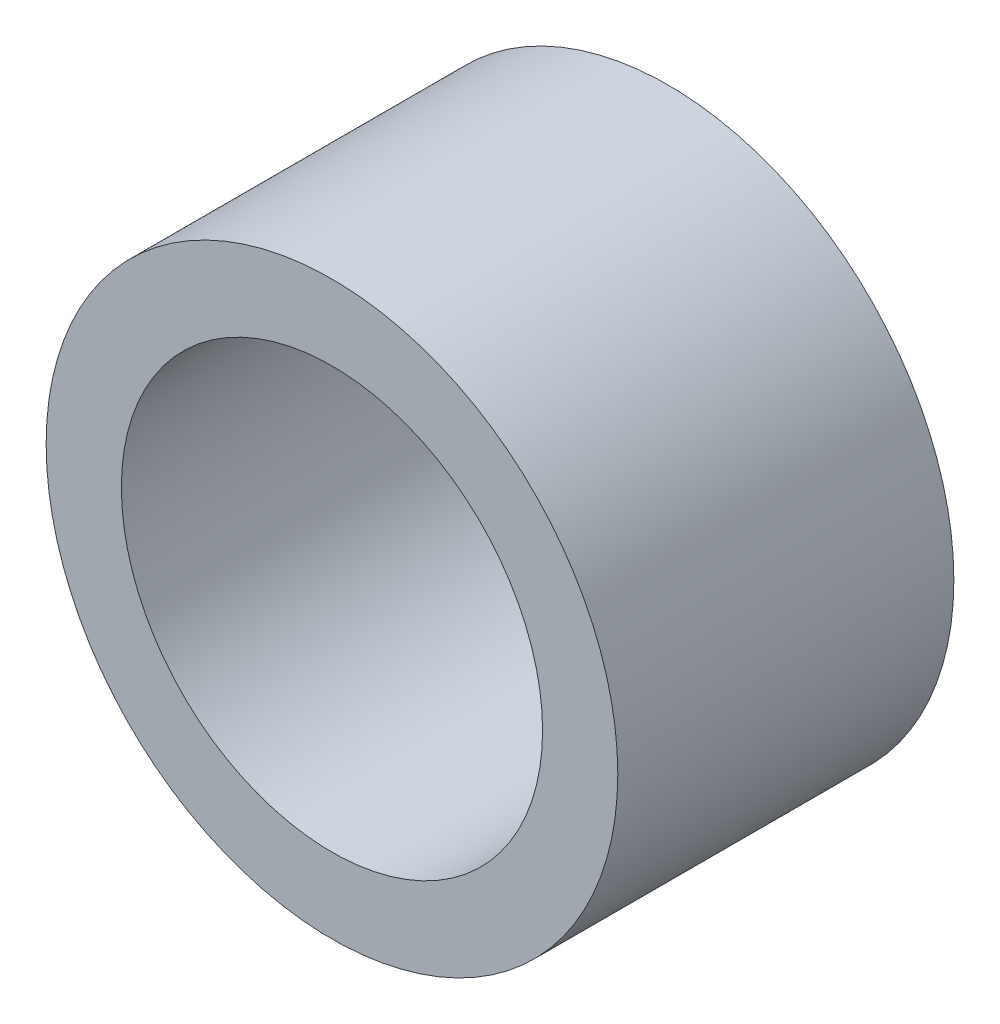
ISO-10303-21;
HEADER;
FILE_DESCRIPTION(('STEP AP214'),'2;1');
FILE_NAME('part.step','',(''),(''),'','','');
FILE_SCHEMA(('AUTOMOTIVE_DESIGN { 1 0 10303 214 1 1 1 1 }'));
ENDSEC;
DATA;
#1=APPLICATION_CONTEXT('core data for automotive mechanical design processes');
#2=APPLICATION_PROTOCOL_DEFINITION('international standard','automotive_design',2000,#1);
#3=PRODUCT_CONTEXT('',#1,'mechanical');
#4=PRODUCT('Part','Part','',(#3));
#5=PRODUCT_RELATED_PRODUCT_CATEGORY('part','',(#4));
#6=PRODUCT_DEFINITION_FORMATION('','',#4);
#7=PRODUCT_DEFINITION_CONTEXT('part definition',#1,'design');
#8=PRODUCT_DEFINITION('design','',#6,#7);
#9=PRODUCT_DEFINITION_SHAPE('','',#8);
#10=(LENGTH_UNIT() NAMED_UNIT(*) SI_UNIT(.MILLI.,.METRE.));
#11=(NAMED_UNIT(*) PLANE_ANGLE_UNIT() SI_UNIT($,.RADIAN.));
#12=(NAMED_UNIT(*) SI_UNIT($,.STERADIAN.) SOLID_ANGLE_UNIT());
#13=UNCERTAINTY_MEASURE_WITH_UNIT(LENGTH_MEASURE(1.E-05),#10,'distance_accuracy_value','');
#14=(GEOMETRIC_REPRESENTATION_CONTEXT(3) GLOBAL_UNCERTAINTY_ASSIGNED_CONTEXT((#13)) GLOBAL_UNIT_ASSIGNED_CONTEXT((#10,
#11,#12)) REPRESENTATION_CONTEXT('',''));
#15=CARTESIAN_POINT('',(0.,0.,0.));
#16=DIRECTION('',(0.,0.,1.));
#17=DIRECTION('',(1.,0.,0.));
#18=AXIS2_PLACEMENT_3D('',#15,#16,#17);
#19=CARTESIAN_POINT('',(0.,0.,5.67436));
#20=DIRECTION('',(0.,0.,1.));
#21=DIRECTION('',(1.,0.,0.));
#22=AXIS2_PLACEMENT_3D('',#19,#20,#21);
#23=PLANE('',#22);
#24=CARTESIAN_POINT('',(0.,0.,5.67436));
#25=DIRECTION('',(0.,0.,1.));
#26=DIRECTION('',(1.,0.,0.));
#27=AXIS2_PLACEMENT_3D('',#24,#25,#26);
#28=CIRCLE('',#27,4.826);
#29=CARTESIAN_POINT('',(4.826,0.,5.67436));
#30=VERTEX_POINT('',#29);
#31=EDGE_CURVE('E10',#30,#30,#28,.T.);
#32=ORIENTED_EDGE('',*,*,#31,.T.);
#33=EDGE_LOOP('',(#32));
#34=FACE_BOUND('',#33,.T.);
#35=CARTESIAN_POINT('',(0.,0.,5.67436));
#36=DIRECTION('',(0.,0.,1.));
#37=DIRECTION('',(1.,0.,0.));
#38=AXIS2_PLACEMENT_3D('',#35,#36,#37);
#39=CIRCLE('',#38,3.556);
#40=CARTESIAN_POINT('',(3.556,0.,5.67436));
#41=VERTEX_POINT('',#40);
#42=EDGE_CURVE('E42',#41,#41,#39,.T.);
#43=ORIENTED_EDGE('',*,*,#42,.F.);
#44=EDGE_LOOP('',(#43));
#45=FACE_BOUND('',#44,.T.);
#46=ADVANCED_FACE('F31',(#34,#45),#23,.T.);
#47=CARTESIAN_POINT('',(0.,0.,0.));
#48=DIRECTION('',(0.,0.,1.));
#49=DIRECTION('',(1.,0.,0.));
#50=AXIS2_PLACEMENT_3D('',#47,#48,#49);
#51=PLANE('',#50);
#52=CARTESIAN_POINT('',(0.,0.,0.));
#53=DIRECTION('',(0.,0.,1.));
#54=DIRECTION('',(1.,0.,0.));
#55=AXIS2_PLACEMENT_3D('',#52,#53,#54);
#56=CIRCLE('',#55,4.826);
#57=CARTESIAN_POINT('',(4.826,0.,0.));
#58=VERTEX_POINT('',#57);
#59=EDGE_CURVE('E35',#58,#58,#56,.T.);
#60=ORIENTED_EDGE('',*,*,#59,.F.);
#61=EDGE_LOOP('',(#60));
#62=FACE_BOUND('',#61,.T.);
#63=CARTESIAN_POINT('',(0.,0.,0.));
#64=DIRECTION('',(0.,0.,1.));
#65=DIRECTION('',(1.,0.,0.));
#66=AXIS2_PLACEMENT_3D('',#63,#64,#65);
#67=CIRCLE('',#66,3.556);
#68=CARTESIAN_POINT('',(3.556,0.,0.));
#69=VERTEX_POINT('',#68);
#70=EDGE_CURVE('E44',#69,#69,#67,.T.);
#71=ORIENTED_EDGE('',*,*,#70,.T.);
#72=EDGE_LOOP('',(#71));
#73=FACE_BOUND('',#72,.T.);
#74=ADVANCED_FACE('F54',(#62,#73),#51,.F.);
#75=CARTESIAN_POINT('',(0.,0.,5.67436));
#76=DIRECTION('',(0.,0.,-1.));
#77=DIRECTION('',(-1.,0.,0.));
#78=AXIS2_PLACEMENT_3D('',#75,#76,#77);
#79=CYLINDRICAL_SURFACE('',#78,4.826);
#80=ORIENTED_EDGE('',*,*,#31,.F.);
#81=EDGE_LOOP('',(#80));
#82=FACE_BOUND('',#81,.T.);
#83=ORIENTED_EDGE('',*,*,#59,.T.);
#84=EDGE_LOOP('',(#83));
#85=FACE_BOUND('',#84,.T.);
#86=ADVANCED_FACE('F33',(#82,#85),#79,.T.);
#87=CARTESIAN_POINT('',(0.,0.,5.67436));
#88=DIRECTION('',(0.,0.,-1.));
#89=DIRECTION('',(-1.,0.,0.));
#90=AXIS2_PLACEMENT_3D('',#87,#88,#89);
#91=CYLINDRICAL_SURFACE('',#90,3.556);
#92=ORIENTED_EDGE('',*,*,#42,.T.);
#93=EDGE_LOOP('',(#92));
#94=FACE_BOUND('',#93,.T.);
#95=ORIENTED_EDGE('',*,*,#70,.F.);
#96=EDGE_LOOP('',(#95));
#97=FACE_BOUND('',#96,.T.);
#98=ADVANCED_FACE('F50',(#94,#97),#91,.F.);
#99=CLOSED_SHELL('',(#46,#74,#86,#98));
#100=MANIFOLD_SOLID_BREP('B2',#99);
#101=ADVANCED_BREP_SHAPE_REPRESENTATION('',(#18,#100),#14);
#102=SHAPE_DEFINITION_REPRESENTATION(#9,#101);
ENDSEC;
END-ISO-10303-21;
